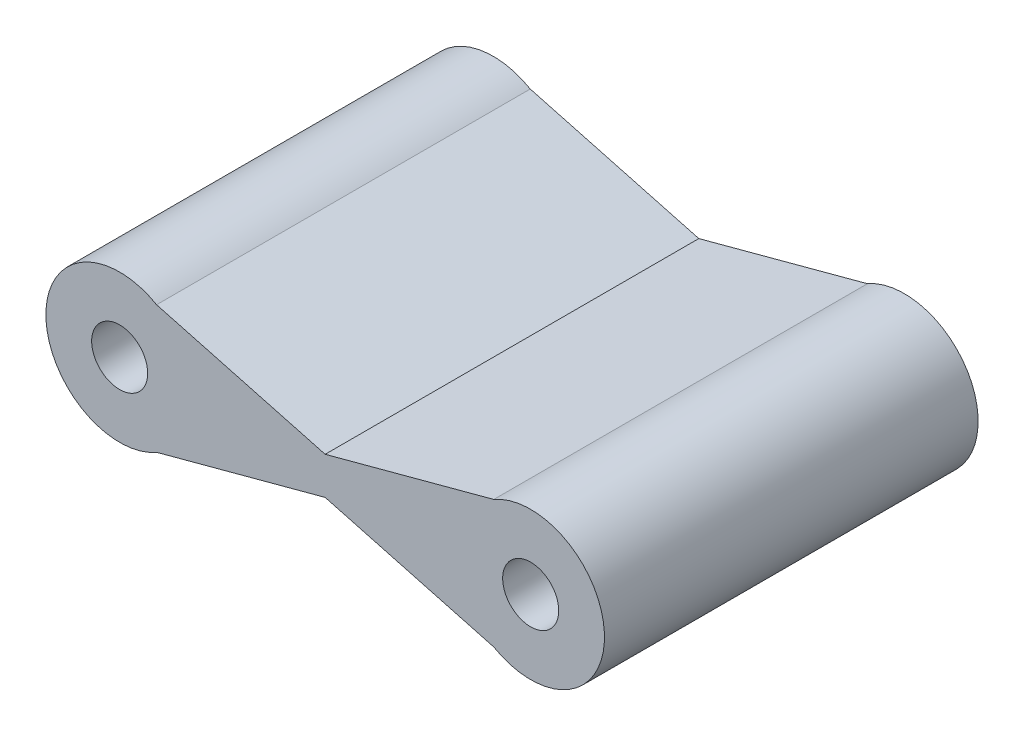
ISO-10303-21;
HEADER;
FILE_DESCRIPTION(('STEP AP214'),'2;1');
FILE_NAME('part.step','',(''),(''),'','','');
FILE_SCHEMA(('AUTOMOTIVE_DESIGN { 1 0 10303 214 1 1 1 1 }'));
ENDSEC;
DATA;
#1=APPLICATION_CONTEXT('core data for automotive mechanical design processes');
#2=APPLICATION_PROTOCOL_DEFINITION('international standard','automotive_design',2000,#1);
#3=PRODUCT_CONTEXT('',#1,'mechanical');
#4=PRODUCT('Part','Part','',(#3));
#5=PRODUCT_RELATED_PRODUCT_CATEGORY('part','',(#4));
#6=PRODUCT_DEFINITION_FORMATION('','',#4);
#7=PRODUCT_DEFINITION_CONTEXT('part definition',#1,'design');
#8=PRODUCT_DEFINITION('design','',#6,#7);
#9=PRODUCT_DEFINITION_SHAPE('','',#8);
#10=(LENGTH_UNIT() NAMED_UNIT(*) SI_UNIT(.MILLI.,.METRE.));
#11=(NAMED_UNIT(*) PLANE_ANGLE_UNIT() SI_UNIT($,.RADIAN.));
#12=(NAMED_UNIT(*) SI_UNIT($,.STERADIAN.) SOLID_ANGLE_UNIT());
#13=UNCERTAINTY_MEASURE_WITH_UNIT(LENGTH_MEASURE(1.E-05),#10,'distance_accuracy_value','');
#14=(GEOMETRIC_REPRESENTATION_CONTEXT(3) GLOBAL_UNCERTAINTY_ASSIGNED_CONTEXT((#13)) GLOBAL_UNIT_ASSIGNED_CONTEXT((#10,
#11,#12)) REPRESENTATION_CONTEXT('',''));
#15=CARTESIAN_POINT('',(0.,0.,0.));
#16=DIRECTION('',(0.,0.,1.));
#17=DIRECTION('',(1.,0.,0.));
#18=AXIS2_PLACEMENT_3D('',#15,#16,#17);
#19=CARTESIAN_POINT('',(0.36902719685434,1.37603361538906,10.));
#20=DIRECTION('',(-0.259028674037289,-0.965869632003452,0.));
#21=DIRECTION('',(0.965869632003452,-0.259028674037289,0.));
#22=AXIS2_PLACEMENT_3D('',#19,#20,#21);
#23=PLANE('',#22);
#24=DIRECTION('',(-0.965869632003452,0.25902867403729,0.));
#25=VECTOR('',#24,1.);
#26=CARTESIAN_POINT('',(0.36902719685434,1.37603361538906,0.));
#27=LINE('',#26,#25);
#28=CARTESIAN_POINT('',(10.0117576762206,-1.20997137680461,0.));
#29=VERTEX_POINT('',#28);
#30=CARTESIAN_POINT('',(5.5,0.,0.));
#31=VERTEX_POINT('',#30);
#32=EDGE_CURVE('E128',#29,#31,#27,.T.);
#33=ORIENTED_EDGE('',*,*,#32,.F.);
#34=DIRECTION('',(0.,0.,-1.));
#35=VECTOR('',#34,1.);
#36=CARTESIAN_POINT('',(10.0117576762206,-1.20997137680461,10.));
#37=LINE('',#36,#35);
#38=CARTESIAN_POINT('',(10.0117576762206,-1.20997137680461,10.));
#39=VERTEX_POINT('',#38);
#40=EDGE_CURVE('E11',#39,#29,#37,.T.);
#41=ORIENTED_EDGE('',*,*,#40,.F.);
#42=DIRECTION('',(-0.965869632003452,0.25902867403729,0.));
#43=VECTOR('',#42,1.);
#44=CARTESIAN_POINT('',(0.36902719685434,1.37603361538906,10.));
#45=LINE('',#44,#43);
#46=CARTESIAN_POINT('',(5.5,0.,10.));
#47=VERTEX_POINT('',#46);
#48=EDGE_CURVE('E188',#39,#47,#45,.T.);
#49=ORIENTED_EDGE('',*,*,#48,.T.);
#50=DIRECTION('',(0.,0.,-1.));
#51=VECTOR('',#50,1.);
#52=CARTESIAN_POINT('',(5.5,0.,10.));
#53=LINE('',#52,#51);
#54=EDGE_CURVE('E81',#47,#31,#53,.T.);
#55=ORIENTED_EDGE('',*,*,#54,.T.);
#56=EDGE_LOOP('',(#33,#41,#49,#55));
#57=FACE_BOUND('',#56,.T.);
#58=ADVANCED_FACE('F35',(#57),#23,.T.);
#59=CARTESIAN_POINT('',(11.,0.5,10.));
#60=DIRECTION('',(0.,0.,-1.));
#61=DIRECTION('',(-1.,0.,0.));
#62=AXIS2_PLACEMENT_3D('',#59,#60,#61);
#63=CYLINDRICAL_SURFACE('',#62,1.975);
#64=CARTESIAN_POINT('',(11.,0.5,0.));
#65=DIRECTION('',(0.,0.,1.));
#66=DIRECTION('',(1.,0.,0.));
#67=AXIS2_PLACEMENT_3D('',#64,#65,#66);
#68=CIRCLE('',#67,1.975);
#69=CARTESIAN_POINT('',(10.0117576762206,2.20997137680461,0.));
#70=VERTEX_POINT('',#69);
#71=EDGE_CURVE('E130',#29,#70,#68,.T.);
#72=ORIENTED_EDGE('',*,*,#71,.T.);
#73=DIRECTION('',(0.,0.,-1.));
#74=VECTOR('',#73,1.);
#75=CARTESIAN_POINT('',(10.0117576762206,2.20997137680461,10.));
#76=LINE('',#75,#74);
#77=CARTESIAN_POINT('',(10.0117576762206,2.20997137680461,10.));
#78=VERTEX_POINT('',#77);
#79=EDGE_CURVE('E44',#78,#70,#76,.T.);
#80=ORIENTED_EDGE('',*,*,#79,.F.);
#81=CARTESIAN_POINT('',(11.,0.5,10.));
#82=DIRECTION('',(0.,0.,1.));
#83=DIRECTION('',(1.,0.,0.));
#84=AXIS2_PLACEMENT_3D('',#81,#82,#83);
#85=CIRCLE('',#84,1.975);
#86=EDGE_CURVE('E117',#39,#78,#85,.T.);
#87=ORIENTED_EDGE('',*,*,#86,.F.);
#88=ORIENTED_EDGE('',*,*,#40,.T.);
#89=EDGE_LOOP('',(#72,#80,#87,#88));
#90=FACE_BOUND('',#89,.T.);
#91=ADVANCED_FACE('F152',(#90),#63,.T.);
#92=CARTESIAN_POINT('',(0.118839266783602,-0.443129469362582,10.));
#93=DIRECTION('',(-0.25902867403729,0.965869632003452,0.));
#94=DIRECTION('',(-0.965869632003452,-0.25902867403729,0.));
#95=AXIS2_PLACEMENT_3D('',#92,#93,#94);
#96=PLANE('',#95);
#97=DIRECTION('',(0.965869632003452,0.25902867403729,0.));
#98=VECTOR('',#97,1.);
#99=CARTESIAN_POINT('',(0.118839266783602,-0.443129469362582,0.));
#100=LINE('',#99,#98);
#101=CARTESIAN_POINT('',(5.5,0.999999999999999,0.));
#102=VERTEX_POINT('',#101);
#103=EDGE_CURVE('E133',#102,#70,#100,.T.);
#104=ORIENTED_EDGE('',*,*,#103,.F.);
#105=DIRECTION('',(0.,0.,-1.));
#106=VECTOR('',#105,1.);
#107=CARTESIAN_POINT('',(5.5,0.999999999999999,10.));
#108=LINE('',#107,#106);
#109=CARTESIAN_POINT('',(5.5,0.999999999999999,10.));
#110=VERTEX_POINT('',#109);
#111=EDGE_CURVE('E104',#110,#102,#108,.T.);
#112=ORIENTED_EDGE('',*,*,#111,.F.);
#113=DIRECTION('',(0.965869632003452,0.25902867403729,0.));
#114=VECTOR('',#113,1.);
#115=CARTESIAN_POINT('',(0.118839266783602,-0.443129469362582,10.));
#116=LINE('',#115,#114);
#117=EDGE_CURVE('E115',#110,#78,#116,.T.);
#118=ORIENTED_EDGE('',*,*,#117,.T.);
#119=ORIENTED_EDGE('',*,*,#79,.T.);
#120=EDGE_LOOP('',(#104,#112,#118,#119));
#121=FACE_BOUND('',#120,.T.);
#122=ADVANCED_FACE('F149',(#121),#96,.T.);
#123=CARTESIAN_POINT('',(0.619215126925079,2.30893776141555,10.));
#124=DIRECTION('',(0.25902867403729,0.965869632003452,0.));
#125=DIRECTION('',(-0.965869632003452,0.25902867403729,0.));
#126=AXIS2_PLACEMENT_3D('',#123,#124,#125);
#127=PLANE('',#126);
#128=DIRECTION('',(0.965869632003452,-0.25902867403729,0.));
#129=VECTOR('',#128,1.);
#130=CARTESIAN_POINT('',(0.619215126925079,2.30893776141555,0.));
#131=LINE('',#130,#129);
#132=CARTESIAN_POINT('',(0.98824232377942,2.20997137680461,0.));
#133=VERTEX_POINT('',#132);
#134=EDGE_CURVE('E101',#133,#102,#131,.T.);
#135=ORIENTED_EDGE('',*,*,#134,.F.);
#136=DIRECTION('',(0.,0.,-1.));
#137=VECTOR('',#136,1.);
#138=CARTESIAN_POINT('',(0.98824232377942,2.20997137680461,10.));
#139=LINE('',#138,#137);
#140=CARTESIAN_POINT('',(0.98824232377942,2.20997137680461,10.));
#141=VERTEX_POINT('',#140);
#142=EDGE_CURVE('E95',#141,#133,#139,.T.);
#143=ORIENTED_EDGE('',*,*,#142,.F.);
#144=DIRECTION('',(0.965869632003452,-0.25902867403729,0.));
#145=VECTOR('',#144,1.);
#146=CARTESIAN_POINT('',(0.619215126925079,2.30893776141555,10.));
#147=LINE('',#146,#145);
#148=EDGE_CURVE('E99',#141,#110,#147,.T.);
#149=ORIENTED_EDGE('',*,*,#148,.T.);
#150=ORIENTED_EDGE('',*,*,#111,.T.);
#151=EDGE_LOOP('',(#135,#143,#149,#150));
#152=FACE_BOUND('',#151,.T.);
#153=ADVANCED_FACE('F97',(#152),#127,.T.);
#154=CARTESIAN_POINT('',(0.,0.5,10.));
#155=DIRECTION('',(0.,0.,-1.));
#156=DIRECTION('',(-1.,0.,0.));
#157=AXIS2_PLACEMENT_3D('',#154,#155,#156);
#158=CYLINDRICAL_SURFACE('',#157,1.975);
#159=CARTESIAN_POINT('',(0.,0.5,0.));
#160=DIRECTION('',(0.,0.,1.));
#161=DIRECTION('',(1.,0.,0.));
#162=AXIS2_PLACEMENT_3D('',#159,#160,#161);
#163=CIRCLE('',#162,1.975);
#164=CARTESIAN_POINT('',(0.988242323779417,-1.20997137680461,0.));
#165=VERTEX_POINT('',#164);
#166=EDGE_CURVE('E137',#133,#165,#163,.T.);
#167=ORIENTED_EDGE('',*,*,#166,.T.);
#168=DIRECTION('',(0.,0.,-1.));
#169=VECTOR('',#168,1.);
#170=CARTESIAN_POINT('',(0.988242323779417,-1.20997137680461,10.));
#171=LINE('',#170,#169);
#172=CARTESIAN_POINT('',(0.988242323779417,-1.20997137680461,10.));
#173=VERTEX_POINT('',#172);
#174=EDGE_CURVE('E105',#173,#165,#171,.T.);
#175=ORIENTED_EDGE('',*,*,#174,.F.);
#176=CARTESIAN_POINT('',(0.,0.5,10.));
#177=DIRECTION('',(0.,0.,1.));
#178=DIRECTION('',(1.,0.,0.));
#179=AXIS2_PLACEMENT_3D('',#176,#177,#178);
#180=CIRCLE('',#179,1.975);
#181=EDGE_CURVE('E108',#141,#173,#180,.T.);
#182=ORIENTED_EDGE('',*,*,#181,.F.);
#183=ORIENTED_EDGE('',*,*,#142,.T.);
#184=EDGE_LOOP('',(#167,#175,#182,#183));
#185=FACE_BOUND('',#184,.T.);
#186=ADVANCED_FACE('F109',(#185),#158,.T.);
#187=CARTESIAN_POINT('',(0.36902719685434,-1.37603361538906,10.));
#188=DIRECTION('',(-0.259028674037289,0.965869632003452,0.));
#189=DIRECTION('',(-0.965869632003452,-0.259028674037289,0.));
#190=AXIS2_PLACEMENT_3D('',#187,#188,#189);
#191=PLANE('',#190);
#192=DIRECTION('',(0.965869632003452,0.259028674037289,0.));
#193=VECTOR('',#192,1.);
#194=CARTESIAN_POINT('',(0.36902719685434,-1.37603361538906,0.));
#195=LINE('',#194,#193);
#196=EDGE_CURVE('E74',#165,#31,#195,.T.);
#197=ORIENTED_EDGE('',*,*,#196,.T.);
#198=ORIENTED_EDGE('',*,*,#54,.F.);
#199=DIRECTION('',(0.965869632003452,0.259028674037289,0.));
#200=VECTOR('',#199,1.);
#201=CARTESIAN_POINT('',(0.36902719685434,-1.37603361538906,10.));
#202=LINE('',#201,#200);
#203=EDGE_CURVE('E52',#173,#47,#202,.T.);
#204=ORIENTED_EDGE('',*,*,#203,.F.);
#205=ORIENTED_EDGE('',*,*,#174,.T.);
#206=EDGE_LOOP('',(#197,#198,#204,#205));
#207=FACE_BOUND('',#206,.T.);
#208=ADVANCED_FACE('F170',(#207),#191,.F.);
#209=CARTESIAN_POINT('',(11.,0.5,10.));
#210=DIRECTION('',(0.,0.,-1.));
#211=DIRECTION('',(-1.,0.,0.));
#212=AXIS2_PLACEMENT_3D('',#209,#210,#211);
#213=CYLINDRICAL_SURFACE('',#212,0.75);
#214=CARTESIAN_POINT('',(11.,0.5,10.));
#215=DIRECTION('',(0.,0.,1.));
#216=DIRECTION('',(1.,0.,0.));
#217=AXIS2_PLACEMENT_3D('',#214,#215,#216);
#218=CIRCLE('',#217,0.75);
#219=CARTESIAN_POINT('',(11.75,0.5,10.));
#220=VERTEX_POINT('',#219);
#221=EDGE_CURVE('E143',#220,#220,#218,.T.);
#222=ORIENTED_EDGE('',*,*,#221,.T.);
#223=EDGE_LOOP('',(#222));
#224=FACE_BOUND('',#223,.T.);
#225=CARTESIAN_POINT('',(11.,0.5,0.));
#226=DIRECTION('',(0.,0.,1.));
#227=DIRECTION('',(1.,0.,0.));
#228=AXIS2_PLACEMENT_3D('',#225,#226,#227);
#229=CIRCLE('',#228,0.75);
#230=CARTESIAN_POINT('',(11.75,0.5,0.));
#231=VERTEX_POINT('',#230);
#232=EDGE_CURVE('E125',#231,#231,#229,.T.);
#233=ORIENTED_EDGE('',*,*,#232,.F.);
#234=EDGE_LOOP('',(#233));
#235=FACE_BOUND('',#234,.T.);
#236=ADVANCED_FACE('F37',(#224,#235),#213,.F.);
#237=CARTESIAN_POINT('',(0.,0.5,10.));
#238=DIRECTION('',(0.,0.,-1.));
#239=DIRECTION('',(-1.,0.,0.));
#240=AXIS2_PLACEMENT_3D('',#237,#238,#239);
#241=CYLINDRICAL_SURFACE('',#240,0.75);
#242=CARTESIAN_POINT('',(0.,0.5,10.));
#243=DIRECTION('',(0.,0.,1.));
#244=DIRECTION('',(1.,0.,0.));
#245=AXIS2_PLACEMENT_3D('',#242,#243,#244);
#246=CIRCLE('',#245,0.75);
#247=CARTESIAN_POINT('',(0.75,0.5,10.));
#248=VERTEX_POINT('',#247);
#249=EDGE_CURVE('E122',#248,#248,#246,.T.);
#250=ORIENTED_EDGE('',*,*,#249,.T.);
#251=EDGE_LOOP('',(#250));
#252=FACE_BOUND('',#251,.T.);
#253=CARTESIAN_POINT('',(0.,0.5,0.));
#254=DIRECTION('',(0.,0.,1.));
#255=DIRECTION('',(1.,0.,0.));
#256=AXIS2_PLACEMENT_3D('',#253,#254,#255);
#257=CIRCLE('',#256,0.75);
#258=CARTESIAN_POINT('',(0.75,0.5,0.));
#259=VERTEX_POINT('',#258);
#260=EDGE_CURVE('E140',#259,#259,#257,.T.);
#261=ORIENTED_EDGE('',*,*,#260,.F.);
#262=EDGE_LOOP('',(#261));
#263=FACE_BOUND('',#262,.T.);
#264=ADVANCED_FACE('F160',(#252,#263),#241,.F.);
#265=CARTESIAN_POINT('',(0.,0.,10.));
#266=DIRECTION('',(0.,0.,1.));
#267=DIRECTION('',(1.,0.,0.));
#268=AXIS2_PLACEMENT_3D('',#265,#266,#267);
#269=PLANE('',#268);
#270=ORIENTED_EDGE('',*,*,#221,.F.);
#271=EDGE_LOOP('',(#270));
#272=FACE_BOUND('',#271,.T.);
#273=ORIENTED_EDGE('',*,*,#48,.F.);
#274=ORIENTED_EDGE('',*,*,#86,.T.);
#275=ORIENTED_EDGE('',*,*,#117,.F.);
#276=ORIENTED_EDGE('',*,*,#148,.F.);
#277=ORIENTED_EDGE('',*,*,#181,.T.);
#278=ORIENTED_EDGE('',*,*,#203,.T.);
#279=EDGE_LOOP('',(#273,#274,#275,#276,#277,#278));
#280=FACE_BOUND('',#279,.T.);
#281=ORIENTED_EDGE('',*,*,#249,.F.);
#282=EDGE_LOOP('',(#281));
#283=FACE_BOUND('',#282,.T.);
#284=ADVANCED_FACE('F112',(#272,#280,#283),#269,.T.);
#285=CARTESIAN_POINT('',(0.,0.,0.));
#286=DIRECTION('',(0.,0.,1.));
#287=DIRECTION('',(1.,0.,0.));
#288=AXIS2_PLACEMENT_3D('',#285,#286,#287);
#289=PLANE('',#288);
#290=ORIENTED_EDGE('',*,*,#232,.T.);
#291=EDGE_LOOP('',(#290));
#292=FACE_BOUND('',#291,.T.);
#293=ORIENTED_EDGE('',*,*,#32,.T.);
#294=ORIENTED_EDGE('',*,*,#196,.F.);
#295=ORIENTED_EDGE('',*,*,#166,.F.);
#296=ORIENTED_EDGE('',*,*,#134,.T.);
#297=ORIENTED_EDGE('',*,*,#103,.T.);
#298=ORIENTED_EDGE('',*,*,#71,.F.);
#299=EDGE_LOOP('',(#293,#294,#295,#296,#297,#298));
#300=FACE_BOUND('',#299,.T.);
#301=ORIENTED_EDGE('',*,*,#260,.T.);
#302=EDGE_LOOP('',(#301));
#303=FACE_BOUND('',#302,.T.);
#304=ADVANCED_FACE('F153',(#292,#300,#303),#289,.F.);
#305=CLOSED_SHELL('',(#58,#91,#122,#153,#186,#208,#236,#264,#284,#304));
#306=MANIFOLD_SOLID_BREP('B2',#305);
#307=ADVANCED_BREP_SHAPE_REPRESENTATION('',(#18,#306),#14);
#308=SHAPE_DEFINITION_REPRESENTATION(#9,#307);
ENDSEC;
END-ISO-10303-21;
